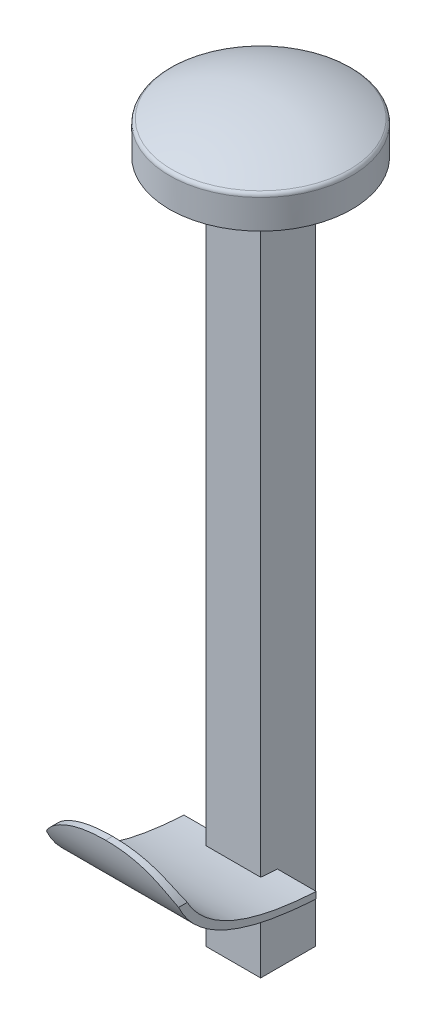
ISO-10303-21;
HEADER;
FILE_DESCRIPTION(('STEP AP214'),'2;1');
FILE_NAME('part.step','',(''),(''),'','','');
FILE_SCHEMA(('AUTOMOTIVE_DESIGN { 1 0 10303 214 1 1 1 1 }'));
ENDSEC;
DATA;
#1=APPLICATION_CONTEXT('core data for automotive mechanical design processes');
#2=APPLICATION_PROTOCOL_DEFINITION('international standard','automotive_design',2000,#1);
#3=PRODUCT_CONTEXT('',#1,'mechanical');
#4=PRODUCT('Part','Part','',(#3));
#5=PRODUCT_RELATED_PRODUCT_CATEGORY('part','',(#4));
#6=PRODUCT_DEFINITION_FORMATION('','',#4);
#7=PRODUCT_DEFINITION_CONTEXT('part definition',#1,'design');
#8=PRODUCT_DEFINITION('design','',#6,#7);
#9=PRODUCT_DEFINITION_SHAPE('','',#8);
#10=(LENGTH_UNIT() NAMED_UNIT(*) SI_UNIT(.MILLI.,.METRE.));
#11=(NAMED_UNIT(*) PLANE_ANGLE_UNIT() SI_UNIT($,.RADIAN.));
#12=(NAMED_UNIT(*) SI_UNIT($,.STERADIAN.) SOLID_ANGLE_UNIT());
#13=UNCERTAINTY_MEASURE_WITH_UNIT(LENGTH_MEASURE(1.E-05),#10,'distance_accuracy_value','');
#14=(GEOMETRIC_REPRESENTATION_CONTEXT(3) GLOBAL_UNCERTAINTY_ASSIGNED_CONTEXT((#13)) GLOBAL_UNIT_ASSIGNED_CONTEXT((#10,
#11,#12)) REPRESENTATION_CONTEXT('',''));
#15=CARTESIAN_POINT('',(0.,0.,0.));
#16=DIRECTION('',(0.,0.,1.));
#17=DIRECTION('',(1.,0.,0.));
#18=AXIS2_PLACEMENT_3D('',#15,#16,#17);
#19=CARTESIAN_POINT('',(0.6,-15.,0.6));
#20=DIRECTION('',(1.,0.,0.));
#21=DIRECTION('',(0.,0.,-1.));
#22=AXIS2_PLACEMENT_3D('',#19,#20,#21);
#23=PLANE('',#22);
#24=DIRECTION('',(0.,-1.,0.));
#25=VECTOR('',#24,1.);
#26=CARTESIAN_POINT('',(0.6,-15.,0.231679409230523));
#27=LINE('',#26,#25);
#28=CARTESIAN_POINT('',(0.6,-13.1147953914325,0.231679409230523));
#29=VERTEX_POINT('',#28);
#30=CARTESIAN_POINT('',(0.6,-13.2544495304418,0.231679409230523));
#31=VERTEX_POINT('',#30);
#32=EDGE_CURVE('E319',#29,#31,#27,.T.);
#33=ORIENTED_EDGE('',*,*,#32,.T.);
#34=CARTESIAN_POINT('',(0.6,-11.2822966361782,3.40038466617353));
#35=CARTESIAN_POINT('',(0.6,-13.0899725130814,3.27973130595993));
#36=CARTESIAN_POINT('',(0.6,-13.2544495304418,0.231679409230523));
#37=B_SPLINE_CURVE_WITH_KNOTS('',2,(#34,#35,#36),.UNSPECIFIED.,.F.,.F.,(3,3),(0.,1.),.UNSPECIFIED.);
#38=CARTESIAN_POINT('',(0.6,-13.2275877017075,0.600000000000006));
#39=VERTEX_POINT('',#38);
#40=EDGE_CURVE('E328',#31,#39,#37,.F.);
#41=ORIENTED_EDGE('',*,*,#40,.T.);
#42=DIRECTION('',(0.,1.,0.));
#43=VECTOR('',#42,1.);
#44=CARTESIAN_POINT('',(0.6,-15.,0.6));
#45=LINE('',#44,#43);
#46=CARTESIAN_POINT('',(0.6,-15.,0.6));
#47=VERTEX_POINT('',#46);
#48=EDGE_CURVE('E243',#47,#39,#45,.T.);
#49=ORIENTED_EDGE('',*,*,#48,.F.);
#50=DIRECTION('',(0.,0.,-1.));
#51=VECTOR('',#50,1.);
#52=CARTESIAN_POINT('',(0.6,-15.,0.6));
#53=LINE('',#52,#51);
#54=CARTESIAN_POINT('',(0.6,-15.,-0.6));
#55=VERTEX_POINT('',#54);
#56=EDGE_CURVE('E340',#47,#55,#53,.T.);
#57=ORIENTED_EDGE('',*,*,#56,.T.);
#58=DIRECTION('',(0.,1.,0.));
#59=VECTOR('',#58,1.);
#60=CARTESIAN_POINT('',(0.6,-15.,-0.6));
#61=LINE('',#60,#59);
#62=CARTESIAN_POINT('',(0.6,0.,-0.6));
#63=VERTEX_POINT('',#62);
#64=EDGE_CURVE('E252',#55,#63,#61,.T.);
#65=ORIENTED_EDGE('',*,*,#64,.T.);
#66=DIRECTION('',(0.,0.,-1.));
#67=VECTOR('',#66,1.);
#68=CARTESIAN_POINT('',(0.6,0.,0.6));
#69=LINE('',#68,#67);
#70=CARTESIAN_POINT('',(0.6,0.,0.6));
#71=VERTEX_POINT('',#70);
#72=EDGE_CURVE('E339',#71,#63,#69,.T.);
#73=ORIENTED_EDGE('',*,*,#72,.F.);
#74=CARTESIAN_POINT('',(0.6,-13.0865291821494,0.6));
#75=VERTEX_POINT('',#74);
#76=EDGE_CURVE('E249',#75,#71,#45,.T.);
#77=ORIENTED_EDGE('',*,*,#76,.F.);
#78=CARTESIAN_POINT('',(0.6,-13.1147953914325,0.231679409230519));
#79=CARTESIAN_POINT('',(0.6,-12.9555523007735,3.05867371334474));
#80=CARTESIAN_POINT('',(0.6,-11.2822966361782,3.25038466617353));
#81=B_SPLINE_CURVE_WITH_KNOTS('',2,(#78,#79,#80),.UNSPECIFIED.,.F.,.F.,(3,3),(0.,1.),.UNSPECIFIED.);
#82=EDGE_CURVE('E314',#75,#29,#81,.F.);
#83=ORIENTED_EDGE('',*,*,#82,.T.);
#84=EDGE_LOOP('',(#33,#41,#49,#57,#65,#73,#77,#83));
#85=FACE_BOUND('',#84,.T.);
#86=ADVANCED_FACE('F33',(#85),#23,.T.);
#87=CARTESIAN_POINT('',(-0.6,-15.,0.6));
#88=DIRECTION('',(0.,0.,1.));
#89=DIRECTION('',(1.,0.,0.));
#90=AXIS2_PLACEMENT_3D('',#87,#88,#89);
#91=PLANE('',#90);
#92=ORIENTED_EDGE('',*,*,#48,.T.);
#93=DIRECTION('',(-1.,0.,0.));
#94=VECTOR('',#93,1.);
#95=CARTESIAN_POINT('',(1.45,-13.2275877017075,0.600000000000006));
#96=LINE('',#95,#94);
#97=CARTESIAN_POINT('',(-0.6,-13.2275877025786,0.599999990644945));
#98=VERTEX_POINT('',#97);
#99=EDGE_CURVE('E325',#39,#98,#96,.T.);
#100=ORIENTED_EDGE('',*,*,#99,.T.);
#101=DIRECTION('',(0.,1.,0.));
#102=VECTOR('',#101,1.);
#103=CARTESIAN_POINT('',(-0.6,-15.,0.6));
#104=LINE('',#103,#102);
#105=CARTESIAN_POINT('',(-0.6,-15.,0.6));
#106=VERTEX_POINT('',#105);
#107=EDGE_CURVE('E363',#106,#98,#104,.T.);
#108=ORIENTED_EDGE('',*,*,#107,.F.);
#109=DIRECTION('',(1.,0.,0.));
#110=VECTOR('',#109,1.);
#111=CARTESIAN_POINT('',(-0.6,-15.,0.6));
#112=LINE('',#111,#110);
#113=EDGE_CURVE('E350',#106,#47,#112,.T.);
#114=ORIENTED_EDGE('',*,*,#113,.T.);
#115=EDGE_LOOP('',(#92,#100,#108,#114));
#116=FACE_BOUND('',#115,.T.);
#117=ADVANCED_FACE('F220',(#116),#91,.T.);
#118=CARTESIAN_POINT('',(-0.6,-13.0865291830655,0.6));
#119=VERTEX_POINT('',#118);
#120=CARTESIAN_POINT('',(-0.6,0.,0.6));
#121=VERTEX_POINT('',#120);
#122=EDGE_CURVE('E365',#119,#121,#104,.T.);
#123=ORIENTED_EDGE('',*,*,#122,.F.);
#124=DIRECTION('',(-1.,0.,0.));
#125=VECTOR('',#124,1.);
#126=CARTESIAN_POINT('',(1.45,-13.0865291821494,0.6));
#127=LINE('',#126,#125);
#128=EDGE_CURVE('E56',#119,#75,#127,.F.);
#129=ORIENTED_EDGE('',*,*,#128,.T.);
#130=ORIENTED_EDGE('',*,*,#76,.T.);
#131=DIRECTION('',(1.,0.,0.));
#132=VECTOR('',#131,1.);
#133=CARTESIAN_POINT('',(-0.6,0.,0.6));
#134=LINE('',#133,#132);
#135=EDGE_CURVE('E344',#121,#71,#134,.T.);
#136=ORIENTED_EDGE('',*,*,#135,.F.);
#137=EDGE_LOOP('',(#123,#129,#130,#136));
#138=FACE_BOUND('',#137,.T.);
#139=ADVANCED_FACE('F223',(#138),#91,.T.);
#140=CARTESIAN_POINT('',(-0.6,-15.,0.6));
#141=DIRECTION('',(-1.,0.,0.));
#142=DIRECTION('',(0.,0.,1.));
#143=AXIS2_PLACEMENT_3D('',#140,#141,#142);
#144=PLANE('',#143);
#145=ORIENTED_EDGE('',*,*,#107,.T.);
#146=CARTESIAN_POINT('',(-0.6,-11.2822966361782,3.40038466617353));
#147=CARTESIAN_POINT('',(-0.6,-13.0899725130814,3.27973130595993));
#148=CARTESIAN_POINT('',(-0.6,-13.2544495304418,0.231679409230523));
#149=B_SPLINE_CURVE_WITH_KNOTS('',2,(#146,#147,#148),.UNSPECIFIED.,.F.,.F.,(3,3),(0.,1.),.UNSPECIFIED.);
#150=CARTESIAN_POINT('',(-0.6,-13.2544495304418,0.231679409230523));
#151=VERTEX_POINT('',#150);
#152=EDGE_CURVE('E264',#98,#151,#149,.T.);
#153=ORIENTED_EDGE('',*,*,#152,.T.);
#154=DIRECTION('',(0.,1.,0.));
#155=VECTOR('',#154,1.);
#156=CARTESIAN_POINT('',(-0.6,-15.,0.231679409230523));
#157=LINE('',#156,#155);
#158=CARTESIAN_POINT('',(-0.6,-13.1147953914325,0.231679409230523));
#159=VERTEX_POINT('',#158);
#160=EDGE_CURVE('E258',#151,#159,#157,.T.);
#161=ORIENTED_EDGE('',*,*,#160,.T.);
#162=CARTESIAN_POINT('',(-0.6,-13.1147953914325,0.231679409230519));
#163=CARTESIAN_POINT('',(-0.6,-12.9555523007735,3.05867371334474));
#164=CARTESIAN_POINT('',(-0.6,-11.2822966361782,3.25038466617353));
#165=B_SPLINE_CURVE_WITH_KNOTS('',2,(#162,#163,#164),.UNSPECIFIED.,.F.,.F.,(3,3),(0.,1.),.UNSPECIFIED.);
#166=EDGE_CURVE('E246',#159,#119,#165,.T.);
#167=ORIENTED_EDGE('',*,*,#166,.T.);
#168=ORIENTED_EDGE('',*,*,#122,.T.);
#169=DIRECTION('',(0.,0.,1.));
#170=VECTOR('',#169,1.);
#171=CARTESIAN_POINT('',(-0.6,0.,0.6));
#172=LINE('',#171,#170);
#173=CARTESIAN_POINT('',(-0.6,0.,-0.6));
#174=VERTEX_POINT('',#173);
#175=EDGE_CURVE('E358',#174,#121,#172,.T.);
#176=ORIENTED_EDGE('',*,*,#175,.F.);
#177=DIRECTION('',(0.,1.,0.));
#178=VECTOR('',#177,1.);
#179=CARTESIAN_POINT('',(-0.6,-15.,-0.6));
#180=LINE('',#179,#178);
#181=CARTESIAN_POINT('',(-0.6,-15.,-0.6));
#182=VERTEX_POINT('',#181);
#183=EDGE_CURVE('E366',#182,#174,#180,.T.);
#184=ORIENTED_EDGE('',*,*,#183,.F.);
#185=DIRECTION('',(0.,0.,1.));
#186=VECTOR('',#185,1.);
#187=CARTESIAN_POINT('',(-0.6,-15.,0.6));
#188=LINE('',#187,#186);
#189=EDGE_CURVE('E347',#182,#106,#188,.T.);
#190=ORIENTED_EDGE('',*,*,#189,.T.);
#191=EDGE_LOOP('',(#145,#153,#161,#167,#168,#176,#184,#190));
#192=FACE_BOUND('',#191,.T.);
#193=ADVANCED_FACE('F225',(#192),#144,.T.);
#194=CARTESIAN_POINT('',(-0.6,-15.,-0.6));
#195=DIRECTION('',(0.,0.,-1.));
#196=DIRECTION('',(-1.,0.,0.));
#197=AXIS2_PLACEMENT_3D('',#194,#195,#196);
#198=PLANE('',#197);
#199=DIRECTION('',(-1.,0.,0.));
#200=VECTOR('',#199,1.);
#201=CARTESIAN_POINT('',(-0.6,0.,-0.6));
#202=LINE('',#201,#200);
#203=EDGE_CURVE('E355',#63,#174,#202,.T.);
#204=ORIENTED_EDGE('',*,*,#203,.F.);
#205=ORIENTED_EDGE('',*,*,#64,.F.);
#206=DIRECTION('',(-1.,0.,0.));
#207=VECTOR('',#206,1.);
#208=CARTESIAN_POINT('',(-0.6,-15.,-0.6));
#209=LINE('',#208,#207);
#210=EDGE_CURVE('E343',#55,#182,#209,.T.);
#211=ORIENTED_EDGE('',*,*,#210,.T.);
#212=ORIENTED_EDGE('',*,*,#183,.T.);
#213=EDGE_LOOP('',(#204,#205,#211,#212));
#214=FACE_BOUND('',#213,.T.);
#215=ADVANCED_FACE('F218',(#214),#198,.T.);
#216=CARTESIAN_POINT('',(0.,-15.,0.));
#217=DIRECTION('',(0.,-1.,0.));
#218=DIRECTION('',(0.,0.,-1.));
#219=AXIS2_PLACEMENT_3D('',#216,#217,#218);
#220=PLANE('',#219);
#221=ORIENTED_EDGE('',*,*,#56,.F.);
#222=ORIENTED_EDGE('',*,*,#113,.F.);
#223=ORIENTED_EDGE('',*,*,#189,.F.);
#224=ORIENTED_EDGE('',*,*,#210,.F.);
#225=EDGE_LOOP('',(#221,#222,#223,#224));
#226=FACE_BOUND('',#225,.T.);
#227=ADVANCED_FACE('F214',(#226),#220,.T.);
#228=CARTESIAN_POINT('',(0.,0.7,0.));
#229=DIRECTION('',(0.,-1.,0.));
#230=DIRECTION('',(0.,0.,-1.));
#231=AXIS2_PLACEMENT_3D('',#228,#229,#230);
#232=CYLINDRICAL_SURFACE('',#231,2.);
#233=CARTESIAN_POINT('',(0.,0.639512162874653,0.));
#234=DIRECTION('',(0.,-1.,0.));
#235=DIRECTION('',(0.,0.,-1.));
#236=AXIS2_PLACEMENT_3D('',#233,#234,#235);
#237=CIRCLE('',#236,2.);
#238=CARTESIAN_POINT('',(0.,0.639512162874653,-2.));
#239=VERTEX_POINT('',#238);
#240=EDGE_CURVE('E242',#239,#239,#237,.T.);
#241=ORIENTED_EDGE('',*,*,#240,.T.);
#242=EDGE_LOOP('',(#241));
#243=FACE_BOUND('',#242,.T.);
#244=CARTESIAN_POINT('',(0.,0.,0.));
#245=DIRECTION('',(0.,1.,0.));
#246=DIRECTION('',(0.,0.,1.));
#247=AXIS2_PLACEMENT_3D('',#244,#245,#246);
#248=CIRCLE('',#247,2.);
#249=CARTESIAN_POINT('',(0.,0.,2.));
#250=VERTEX_POINT('',#249);
#251=EDGE_CURVE('E333',#250,#250,#248,.T.);
#252=ORIENTED_EDGE('',*,*,#251,.T.);
#253=EDGE_LOOP('',(#252));
#254=FACE_BOUND('',#253,.T.);
#255=ADVANCED_FACE('F211',(#243,#254),#232,.T.);
#256=CARTESIAN_POINT('',(0.,-3.05,0.));
#257=DIRECTION('',(0.,0.,1.));
#258=DIRECTION('',(1.,0.,0.));
#259=AXIS2_PLACEMENT_3D('',#256,#257,#258);
#260=SPHERICAL_SURFACE('',#259,4.25);
#261=CARTESIAN_POINT('',(0.,-3.05,0.));
#262=DIRECTION('',(0.,-1.,0.));
#263=DIRECTION('',(0.,0.,-1.));
#264=AXIS2_PLACEMENT_3D('',#261,#262,#263);
#265=SPHERICAL_SURFACE('',#264,4.25);
#266=CARTESIAN_POINT('',(0.,0.728416070413801,0.));
#267=DIRECTION('',(0.,-1.,0.));
#268=DIRECTION('',(0.,0.,-1.));
#269=AXIS2_PLACEMENT_3D('',#266,#267,#268);
#270=CIRCLE('',#269,1.94578313253012);
#271=CARTESIAN_POINT('',(0.,0.728416070413801,-1.94578313253012));
#272=VERTEX_POINT('',#271);
#273=EDGE_CURVE('E240',#272,#272,#270,.F.);
#274=ORIENTED_EDGE('',*,*,#273,.T.);
#275=EDGE_LOOP('',(#274));
#276=FACE_BOUND('',#275,.T.);
#277=ADVANCED_FACE('F209',(#276),#265,.T.);
#278=CARTESIAN_POINT('',(0.,0.,0.));
#279=DIRECTION('',(0.,1.,0.));
#280=DIRECTION('',(0.,0.,1.));
#281=AXIS2_PLACEMENT_3D('',#278,#279,#280);
#282=PLANE('',#281);
#283=ORIENTED_EDGE('',*,*,#72,.T.);
#284=ORIENTED_EDGE('',*,*,#203,.T.);
#285=ORIENTED_EDGE('',*,*,#175,.T.);
#286=ORIENTED_EDGE('',*,*,#135,.T.);
#287=EDGE_LOOP('',(#283,#284,#285,#286));
#288=FACE_BOUND('',#287,.T.);
#289=ORIENTED_EDGE('',*,*,#251,.F.);
#290=EDGE_LOOP('',(#289));
#291=FACE_BOUND('',#290,.T.);
#292=ADVANCED_FACE('F205',(#288,#291),#282,.F.);
#293=CARTESIAN_POINT('',(0.,0.639512162874653,0.));
#294=DIRECTION('',(0.,-1.,0.));
#295=DIRECTION('',(0.,0.,-1.));
#296=AXIS2_PLACEMENT_3D('',#293,#294,#295);
#297=TOROIDAL_SURFACE('',#296,1.9,0.1);
#298=ORIENTED_EDGE('',*,*,#240,.F.);
#299=EDGE_LOOP('',(#298));
#300=FACE_BOUND('',#299,.T.);
#301=ORIENTED_EDGE('',*,*,#273,.F.);
#302=EDGE_LOOP('',(#301));
#303=FACE_BOUND('',#302,.T.);
#304=ADVANCED_FACE('F35',(#300,#303),#297,.T.);
#305=CARTESIAN_POINT('',(1.45,-13.1147953914325,0.231679409230523));
#306=DIRECTION('',(0.,0.,1.));
#307=DIRECTION('',(1.,0.,0.));
#308=AXIS2_PLACEMENT_3D('',#305,#306,#307);
#309=PLANE('',#308);
#310=ORIENTED_EDGE('',*,*,#32,.F.);
#311=DIRECTION('',(-1.,0.,0.));
#312=VECTOR('',#311,1.);
#313=CARTESIAN_POINT('',(1.45,-13.1147953914325,0.231679409230523));
#314=LINE('',#313,#312);
#315=CARTESIAN_POINT('',(1.45,-13.1147953914325,0.231679409230523));
#316=VERTEX_POINT('',#315);
#317=EDGE_CURVE('E285',#316,#29,#314,.T.);
#318=ORIENTED_EDGE('',*,*,#317,.F.);
#319=DIRECTION('',(0.,1.,0.));
#320=VECTOR('',#319,1.);
#321=CARTESIAN_POINT('',(1.45,-13.1147953914325,0.231679409230523));
#322=LINE('',#321,#320);
#323=CARTESIAN_POINT('',(1.45,-13.2544495304418,0.231679409230523));
#324=VERTEX_POINT('',#323);
#325=EDGE_CURVE('E281',#324,#316,#322,.T.);
#326=ORIENTED_EDGE('',*,*,#325,.F.);
#327=DIRECTION('',(-1.,0.,0.));
#328=VECTOR('',#327,1.);
#329=CARTESIAN_POINT('',(1.45,-13.2544495304418,0.231679409230523));
#330=LINE('',#329,#328);
#331=EDGE_CURVE('E310',#324,#31,#330,.T.);
#332=ORIENTED_EDGE('',*,*,#331,.T.);
#333=EDGE_LOOP('',(#310,#318,#326,#332));
#334=FACE_BOUND('',#333,.T.);
#335=ADVANCED_FACE('F203',(#334),#309,.F.);
#336=CARTESIAN_POINT('',(1.45,-11.2822966361782,3.40038466617353));
#337=CARTESIAN_POINT('',(1.45,-13.0899725130814,3.27973130595993));
#338=CARTESIAN_POINT('',(1.45,-13.2544495304418,0.231679409230523));
#339=B_SPLINE_CURVE_WITH_KNOTS('',2,(#336,#337,#338),.UNSPECIFIED.,.F.,.F.,(3,3),(0.,1.),.UNSPECIFIED.);
#340=DIRECTION('',(-1.,0.,0.));
#341=VECTOR('',#340,1.);
#342=SURFACE_OF_LINEAR_EXTRUSION('',#339,#341);
#343=CARTESIAN_POINT('',(1.45,-11.9088053983222,3.24934951916116));
#344=VERTEX_POINT('',#343);
#345=EDGE_CURVE('E193',#344,#324,#339,.T.);
#346=ORIENTED_EDGE('',*,*,#345,.F.);
#347=CARTESIAN_POINT('',(1.45,-11.9088053983222,3.24934952030039));
#348=CARTESIAN_POINT('',(1.43209086909889,-11.8824739749466,3.26125065203179));
#349=CARTESIAN_POINT('',(1.41301831415374,-11.8564774593776,3.27213410331805));
#350=CARTESIAN_POINT('',(1.37263271580729,-11.8055517308266,3.29201932509979));
#351=CARTESIAN_POINT('',(1.3513209466864,-11.7806219220546,3.30102215718458));
#352=CARTESIAN_POINT('',(1.30673879784926,-11.7324298684638,3.31723439768556));
#353=CARTESIAN_POINT('',(1.28348928340076,-11.7091538631586,3.32446026065177));
#354=CARTESIAN_POINT('',(1.23503195343132,-11.6643025991762,3.33743383390888));
#355=CARTESIAN_POINT('',(1.20982407960209,-11.6427273911774,3.3431815001659));
#356=CARTESIAN_POINT('',(1.13163368759762,-11.5809525947777,3.35852392104764));
#357=CARTESIAN_POINT('',(1.07599002531331,-11.5436015030161,3.36625002605092));
#358=CARTESIAN_POINT('',(0.959570366887024,-11.4772187084085,3.37839166681402));
#359=CARTESIAN_POINT('',(0.898783615694367,-11.4482050263387,3.38280006434307));
#360=CARTESIAN_POINT('',(0.787745266314783,-11.4036480363033,3.38885114047055));
#361=CARTESIAN_POINT('',(0.738124345587958,-11.3865452379275,3.3908892323137));
#362=CARTESIAN_POINT('',(0.637543499359318,-11.3567271857328,3.3941592938901));
#363=CARTESIAN_POINT('',(0.586582751503276,-11.3440146975904,3.3953907559231));
#364=CARTESIAN_POINT('',(0.4322612771528,-11.3116904021231,3.39833926992597));
#365=CARTESIAN_POINT('',(0.327633033363799,-11.2979559247601,3.39930360307876));
#366=CARTESIAN_POINT('',(0.185563943596458,-11.2874882560939,3.40003103665554));
#367=CARTESIAN_POINT('',(0.148365142391725,-11.2855036558504,3.4001677134941));
#368=CARTESIAN_POINT('',(0.0741154311563454,-11.2829125873477,3.40034475106083));
#369=CARTESIAN_POINT('',(0.0370647793662433,-11.2822988864633,3.40038561732575));
#370=CARTESIAN_POINT('',(0.,-11.2822966361782,3.40038466617353));
#371=B_SPLINE_CURVE_WITH_KNOTS('',3,(#347,#348,#349,#350,#351,#352,#353,#354,#355,#356,#357,
#358,#359,#360,#361,#362,#363,#364,#365,#366,#367,#368,#369,#370),.UNSPECIFIED.,.F.,.F.,(4,2,2,
2,2,2,2,2,2,2,2,4),(0.,0.101947827344852,0.203837949789108,0.304745689454117,0.405656434703983,
0.607055334481566,0.808886325953734,0.966235775021782,1.12368416636158,1.43912495951979,
1.55087424765936,1.66203255956032),.UNSPECIFIED.);
#372=CARTESIAN_POINT('',(0.,-11.2822966361782,3.40038466617353));
#373=VERTEX_POINT('',#372);
#374=EDGE_CURVE('E135',#344,#373,#371,.T.);
#375=ORIENTED_EDGE('',*,*,#374,.T.);
#376=CARTESIAN_POINT('',(0.,-11.2822966361782,3.40038466617353));
#377=CARTESIAN_POINT('',(-0.0565959525179161,-11.2823102490029,3.40037399735679));
#378=CARTESIAN_POINT('',(-0.113223586391407,-11.2837350077479,3.4002876736812));
#379=CARTESIAN_POINT('',(-0.22644954128403,-11.2899293075039,3.39986664896325));
#380=CARTESIAN_POINT('',(-0.283047329922659,-11.2947082636571,3.39953124861509));
#381=CARTESIAN_POINT('',(-0.396634880816,-11.3082387643143,3.39850643025248));
#382=CARTESIAN_POINT('',(-0.453618014022299,-11.3170481549776,3.39781183738383));
#383=CARTESIAN_POINT('',(-0.56661403674673,-11.3392716517808,3.39584627449918));
#384=CARTESIAN_POINT('',(-0.622627965006768,-11.3526804600949,3.39457596707986));
#385=CARTESIAN_POINT('',(-0.749287389432965,-11.3894412123304,3.3906021505441));
#386=CARTESIAN_POINT('',(-0.819431594598115,-11.4145529985423,3.38758854459759));
#387=CARTESIAN_POINT('',(-0.954981386891236,-11.4746601564423,3.3787447466682));
#388=CARTESIAN_POINT('',(-1.02040508675389,-11.5096149138197,3.3729260602652));
#389=CARTESIAN_POINT('',(-1.11363299536872,-11.5698062274826,3.36057618006418));
#390=CARTESIAN_POINT('',(-1.14409237183304,-11.5913472747574,3.35580809662948));
#391=CARTESIAN_POINT('',(-1.20285351482054,-11.6368320092052,3.34473925127545));
#392=CARTESIAN_POINT('',(-1.23115644994918,-11.6607743785367,3.33843932735276));
#393=CARTESIAN_POINT('',(-1.28527510744216,-11.7107502194293,3.32401299668349));
#394=CARTESIAN_POINT('',(-1.31109407617326,-11.7367808778002,3.31588902146838));
#395=CARTESIAN_POINT('',(-1.36005641932565,-11.7905326558687,3.29753341362979));
#396=CARTESIAN_POINT('',(-1.38320193168449,-11.81825239734,3.28730348359163));
#397=CARTESIAN_POINT('',(-1.41283027534128,-11.856798353774,3.27179437304193));
#398=CARTESIAN_POINT('',(-1.42052253275474,-11.8671193083931,3.26752072307189));
#399=CARTESIAN_POINT('',(-1.43553598045608,-11.8878778184843,3.25866741147943));
#400=CARTESIAN_POINT('',(-1.44285760564309,-11.8983152188944,3.25408812384884));
#401=CARTESIAN_POINT('',(-1.45000000000005,-11.9088053983221,3.24934952030042));
#402=B_SPLINE_CURVE_WITH_KNOTS('',3,(#376,#377,#378,#379,#380,#381,#382,#383,#384,#385,#386,
#387,#388,#389,#390,#391,#392,#393,#394,#395,#396,#397,#398,#399,#400,#401),.UNSPECIFIED.,.F.,
.F.,(4,2,2,2,2,2,2,2,2,2,2,2,4),(0.,0.16981764128963,0.340113872460541,0.512934872354031,
0.685557473646718,0.908564262733787,1.13066402999565,1.24335065416665,1.3559757710225,
1.46845163629165,1.58083692366758,1.621519328359,1.66215283392657),.UNSPECIFIED.);
#403=CARTESIAN_POINT('',(-1.45,-11.9088053983222,3.24934951916116));
#404=VERTEX_POINT('',#403);
#405=EDGE_CURVE('E136',#373,#404,#402,.T.);
#406=ORIENTED_EDGE('',*,*,#405,.T.);
#407=CARTESIAN_POINT('',(-1.45,-11.2822966361782,3.40038466617353));
#408=CARTESIAN_POINT('',(-1.45,-13.0899725130814,3.27973130595993));
#409=CARTESIAN_POINT('',(-1.45,-13.2544495304418,0.231679409230523));
#410=B_SPLINE_CURVE_WITH_KNOTS('',2,(#407,#408,#409),.UNSPECIFIED.,.F.,.F.,(3,3),(0.,1.),.UNSPECIFIED.);
#411=CARTESIAN_POINT('',(-1.45,-13.2544495304418,0.231679409230523));
#412=VERTEX_POINT('',#411);
#413=EDGE_CURVE('E192',#404,#412,#410,.T.);
#414=ORIENTED_EDGE('',*,*,#413,.T.);
#415=EDGE_CURVE('E309',#151,#412,#330,.T.);
#416=ORIENTED_EDGE('',*,*,#415,.F.);
#417=ORIENTED_EDGE('',*,*,#152,.F.);
#418=ORIENTED_EDGE('',*,*,#99,.F.);
#419=ORIENTED_EDGE('',*,*,#40,.F.);
#420=ORIENTED_EDGE('',*,*,#331,.F.);
#421=EDGE_LOOP('',(#346,#375,#406,#414,#416,#417,#418,#419,#420));
#422=FACE_BOUND('',#421,.T.);
#423=ADVANCED_FACE('F198',(#422),#342,.F.);
#424=ORIENTED_EDGE('',*,*,#160,.F.);
#425=ORIENTED_EDGE('',*,*,#415,.T.);
#426=DIRECTION('',(0.,1.,0.));
#427=VECTOR('',#426,1.);
#428=CARTESIAN_POINT('',(-1.45,-13.1147953914325,0.231679409230523));
#429=LINE('',#428,#427);
#430=CARTESIAN_POINT('',(-1.45,-13.1147953914325,0.231679409230523));
#431=VERTEX_POINT('',#430);
#432=EDGE_CURVE('E297',#412,#431,#429,.T.);
#433=ORIENTED_EDGE('',*,*,#432,.T.);
#434=EDGE_CURVE('E284',#159,#431,#314,.T.);
#435=ORIENTED_EDGE('',*,*,#434,.F.);
#436=EDGE_LOOP('',(#424,#425,#433,#435));
#437=FACE_BOUND('',#436,.T.);
#438=ADVANCED_FACE('F202',(#437),#309,.F.);
#439=CARTESIAN_POINT('',(1.45,-13.1147953914325,0.231679409230519));
#440=CARTESIAN_POINT('',(1.45,-12.9555523007735,3.05867371334474));
#441=CARTESIAN_POINT('',(1.45,-11.2822966361782,3.25038466617353));
#442=B_SPLINE_CURVE_WITH_KNOTS('',2,(#439,#440,#441),.UNSPECIFIED.,.F.,.F.,(3,3),(0.,1.),.UNSPECIFIED.);
#443=DIRECTION('',(-1.,0.,0.));
#444=VECTOR('',#443,1.);
#445=SURFACE_OF_LINEAR_EXTRUSION('',#442,#444);
#446=CARTESIAN_POINT('',(-1.45,-11.9088053983222,3.05882547745143));
#447=CARTESIAN_POINT('',(-1.43284793340806,-11.883588612597,3.07247349815652));
#448=CARTESIAN_POINT('',(-1.41456672715221,-11.8585869903981,3.08509719296298));
#449=CARTESIAN_POINT('',(-1.37580760218546,-11.8094177250805,3.10840500957885));
#450=CARTESIAN_POINT('',(-1.35533074559003,-11.7852496861387,3.11909006250528));
#451=CARTESIAN_POINT('',(-1.31242954916155,-11.7383495229776,3.13854993547235));
#452=CARTESIAN_POINT('',(-1.2900255077643,-11.7156059599394,3.14734190134926));
#453=CARTESIAN_POINT('',(-1.24326234948341,-11.671626738566,3.16331638398273));
#454=CARTESIAN_POINT('',(-1.21890322845585,-11.6503910834271,3.17049889732784));
#455=CARTESIAN_POINT('',(-1.14321426565299,-11.5893682554979,3.18992108469811));
#456=CARTESIAN_POINT('',(-1.0892010105591,-11.5521861723862,3.20006617766444));
#457=CARTESIAN_POINT('',(-0.975935847011846,-11.485734141261,3.21642209465019));
#458=CARTESIAN_POINT('',(-0.916673910778248,-11.4564797918076,3.22262519420636));
#459=CARTESIAN_POINT('',(-0.809042944328183,-11.4116172206298,3.23132531462971));
#460=CARTESIAN_POINT('',(-0.761361648121919,-11.3944176411614,3.23434950436084));
#461=CARTESIAN_POINT('',(-0.664632478804275,-11.3641784328833,3.23934452704094));
#462=CARTESIAN_POINT('',(-0.615583800692822,-11.3511413133217,3.24131472509555));
#463=CARTESIAN_POINT('',(-0.466901720220225,-11.3175825451623,3.24616503746172));
#464=CARTESIAN_POINT('',(-0.365942012982798,-11.3026954312571,3.24797151449744));
#465=CARTESIAN_POINT('',(-0.220465485763319,-11.289694351808,3.24952371916684));
#466=CARTESIAN_POINT('',(-0.176254326609848,-11.2868558730349,3.2498570858636));
#467=CARTESIAN_POINT('',(-0.0880330905912737,-11.2831661332388,3.25028655288794));
#468=CARTESIAN_POINT('',(-0.0440235665345233,-11.2823021174999,3.25038417631328));
#469=CARTESIAN_POINT('',(0.,-11.2822966361782,3.25038466617353));
#470=B_SPLINE_CURVE_WITH_KNOTS('',3,(#446,#447,#448,#449,#450,#451,#452,#453,#454,#455,#456,
#457,#458,#459,#460,#461,#462,#463,#464,#465,#466,#467,#468,#469),.UNSPECIFIED.,.F.,.F.,(4,2,2,
2,2,2,2,2,2,2,2,4),(0.,0.100199327351853,0.200350401484393,0.299552213601671,0.398754235988861,
0.596829480043647,0.795291671740478,0.947411363447353,1.09962258480847,1.40471391907886,
1.53760333389592,1.66963184785068),.UNSPECIFIED.);
#471=CARTESIAN_POINT('',(-1.45,-11.9088054064231,3.05882547306985));
#472=VERTEX_POINT('',#471);
#473=CARTESIAN_POINT('',(0.,-11.2822966361782,3.25038466617353));
#474=VERTEX_POINT('',#473);
#475=EDGE_CURVE('E48',#472,#474,#470,.T.);
#476=ORIENTED_EDGE('',*,*,#475,.T.);
#477=CARTESIAN_POINT('',(0.,-11.2822966361782,3.25038466617353));
#478=CARTESIAN_POINT('',(0.0565859991671263,-11.2823101159814,3.25037257590209));
#479=CARTESIAN_POINT('',(0.1132041380054,-11.2837344927612,3.25021885230542));
#480=CARTESIAN_POINT('',(0.226413695108602,-11.2899267920347,3.24950120945531));
#481=CARTESIAN_POINT('',(0.28300456203583,-11.2947043771082,3.24893610459322));
#482=CARTESIAN_POINT('',(0.396602497345849,-11.3082336837692,3.24725458223599));
#483=CARTESIAN_POINT('',(0.453602641246732,-11.3170452220329,3.24612984369933));
#484=CARTESIAN_POINT('',(0.566619371861496,-11.3392726106734,3.24306194321012));
#485=CARTESIAN_POINT('',(0.622637043741668,-11.3526829942455,3.2411197523707));
#486=CARTESIAN_POINT('',(0.748274965602354,-11.3891475018581,3.23530970409903));
#487=CARTESIAN_POINT('',(0.817420762638441,-11.413836671568,3.23106022892479));
#488=CARTESIAN_POINT('',(0.951030524559233,-11.4727423466175,3.21921846588915));
#489=CARTESIAN_POINT('',(1.01551321835265,-11.5069177243303,3.21164052784296));
#490=CARTESIAN_POINT('',(1.107408787236,-11.5655837147407,3.19621444454012));
#491=CARTESIAN_POINT('',(1.13743551377857,-11.5865524887177,3.19033814090764));
#492=CARTESIAN_POINT('',(1.19536371829905,-11.6307556073025,3.17691383035436));
#493=CARTESIAN_POINT('',(1.22326634949119,-11.6539887067107,3.16936673936291));
#494=CARTESIAN_POINT('',(1.27662943817739,-11.7024007713887,3.15232208616041));
#495=CARTESIAN_POINT('',(1.30209244121462,-11.7275776578219,3.14282659018426));
#496=CARTESIAN_POINT('',(1.35038440959375,-11.7794573694322,3.12163323562083));
#497=CARTESIAN_POINT('',(1.37321533010974,-11.8061590396261,3.10993702899678));
#498=CARTESIAN_POINT('',(1.40447122831517,-11.8457667434048,3.09118003340752));
#499=CARTESIAN_POINT('',(1.41397856226051,-11.8582785637229,3.08505734355931));
#500=CARTESIAN_POINT('',(1.43241650256809,-11.8834439256005,3.07231667069179));
#501=CARTESIAN_POINT('',(1.44134786181278,-11.8960972556966,3.06569935970375));
#502=CARTESIAN_POINT('',(1.45000000000037,-11.9088053983219,3.05882547745157));
#503=B_SPLINE_CURVE_WITH_KNOTS('',3,(#477,#478,#479,#480,#481,#482,#483,#484,#485,#486,#487,
#488,#489,#490,#491,#492,#493,#494,#495,#496,#497,#498,#499,#500,#501,#502),.UNSPECIFIED.,.F.,
.F.,(4,2,2,2,2,2,2,2,2,2,2,2,4),(0.,0.169788380628174,0.340068041676991,0.512958798982002,
0.685644743488044,0.905605963184354,1.12462804450167,1.23576226037011,1.34683570241846,
1.45779195703395,1.56866525225105,1.61924489172377,1.66975701697921),.UNSPECIFIED.);
#504=CARTESIAN_POINT('',(1.45,-11.9088053983222,3.05882547306985));
#505=VERTEX_POINT('',#504);
#506=EDGE_CURVE('E128',#474,#505,#503,.T.);
#507=ORIENTED_EDGE('',*,*,#506,.T.);
#508=EDGE_CURVE('E280',#316,#505,#442,.T.);
#509=ORIENTED_EDGE('',*,*,#508,.F.);
#510=ORIENTED_EDGE('',*,*,#317,.T.);
#511=ORIENTED_EDGE('',*,*,#82,.F.);
#512=ORIENTED_EDGE('',*,*,#128,.F.);
#513=ORIENTED_EDGE('',*,*,#166,.F.);
#514=ORIENTED_EDGE('',*,*,#434,.T.);
#515=CARTESIAN_POINT('',(-1.45,-13.1147953914325,0.231679409230519));
#516=CARTESIAN_POINT('',(-1.45,-12.9555523007735,3.05867371334474));
#517=CARTESIAN_POINT('',(-1.45,-11.2822966361782,3.25038466617353));
#518=B_SPLINE_CURVE_WITH_KNOTS('',2,(#515,#516,#517),.UNSPECIFIED.,.F.,.F.,(3,3),(0.,1.),.UNSPECIFIED.);
#519=EDGE_CURVE('E144',#431,#472,#518,.T.);
#520=ORIENTED_EDGE('',*,*,#519,.T.);
#521=EDGE_LOOP('',(#476,#507,#509,#510,#511,#512,#513,#514,#520));
#522=FACE_BOUND('',#521,.T.);
#523=ADVANCED_FACE('F142',(#522),#445,.F.);
#524=CARTESIAN_POINT('',(1.45,-12.6791727981957,2.54788167183098));
#525=DIRECTION('',(1.,0.,0.));
#526=DIRECTION('',(0.,0.,-1.));
#527=AXIS2_PLACEMENT_3D('',#524,#525,#526);
#528=PLANE('',#527);
#529=DIRECTION('',(0.,0.,1.));
#530=VECTOR('',#529,1.);
#531=CARTESIAN_POINT('',(1.45,-11.9088053983222,2.6));
#532=LINE('',#531,#530);
#533=EDGE_CURVE('E11',#344,#505,#532,.F.);
#534=ORIENTED_EDGE('',*,*,#533,.F.);
#535=ORIENTED_EDGE('',*,*,#345,.T.);
#536=ORIENTED_EDGE('',*,*,#325,.T.);
#537=ORIENTED_EDGE('',*,*,#508,.T.);
#538=EDGE_LOOP('',(#534,#535,#536,#537));
#539=FACE_BOUND('',#538,.T.);
#540=ADVANCED_FACE('F182',(#539),#528,.T.);
#541=CARTESIAN_POINT('',(-1.45,-12.6791727981957,2.54788167183098));
#542=DIRECTION('',(1.,0.,0.));
#543=DIRECTION('',(0.,0.,-1.));
#544=AXIS2_PLACEMENT_3D('',#541,#542,#543);
#545=PLANE('',#544);
#546=ORIENTED_EDGE('',*,*,#413,.F.);
#547=DIRECTION('',(0.,0.,1.));
#548=VECTOR('',#547,1.);
#549=CARTESIAN_POINT('',(-1.45,-11.9088053983222,2.6));
#550=LINE('',#549,#548);
#551=EDGE_CURVE('E41',#404,#472,#550,.F.);
#552=ORIENTED_EDGE('',*,*,#551,.T.);
#553=ORIENTED_EDGE('',*,*,#519,.F.);
#554=ORIENTED_EDGE('',*,*,#432,.F.);
#555=EDGE_LOOP('',(#546,#552,#553,#554));
#556=FACE_BOUND('',#555,.T.);
#557=ADVANCED_FACE('F181',(#556),#545,.F.);
#558=CARTESIAN_POINT('',(0.,-11.2822966361782,2.6));
#559=CARTESIAN_POINT('',(1.29782262907156,-11.2822966361782,2.6));
#560=CARTESIAN_POINT('',(1.63581938938096,-12.2897703922953,2.6));
#561=B_SPLINE_CURVE_WITH_KNOTS('',2,(#558,#559,#560),.UNSPECIFIED.,.F.,.F.,(3,3),(0.,1.),.UNSPECIFIED.);
#562=DIRECTION('',(0.,0.,1.));
#563=VECTOR('',#562,1.);
#564=SURFACE_OF_LINEAR_EXTRUSION('',#561,#563);
#565=ORIENTED_EDGE('',*,*,#533,.T.);
#566=ORIENTED_EDGE('',*,*,#506,.F.);
#567=DIRECTION('',(0.,0.,1.));
#568=VECTOR('',#567,1.);
#569=CARTESIAN_POINT('',(0.,-11.2822966361782,2.6));
#570=LINE('',#569,#568);
#571=EDGE_CURVE('E130',#474,#373,#570,.T.);
#572=ORIENTED_EDGE('',*,*,#571,.T.);
#573=ORIENTED_EDGE('',*,*,#374,.F.);
#574=EDGE_LOOP('',(#565,#566,#572,#573));
#575=FACE_BOUND('',#574,.T.);
#576=ADVANCED_FACE('F129',(#575),#564,.F.);
#577=CARTESIAN_POINT('',(-1.63581938938096,-12.2897703922953,2.6));
#578=CARTESIAN_POINT('',(-1.29782262907156,-11.2822966361782,2.6));
#579=CARTESIAN_POINT('',(0.,-11.2822966361782,2.6));
#580=B_SPLINE_CURVE_WITH_KNOTS('',2,(#577,#578,#579),.UNSPECIFIED.,.F.,.F.,(3,3),(0.,1.),.UNSPECIFIED.);
#581=DIRECTION('',(0.,0.,1.));
#582=VECTOR('',#581,1.);
#583=SURFACE_OF_LINEAR_EXTRUSION('',#580,#582);
#584=ORIENTED_EDGE('',*,*,#571,.F.);
#585=ORIENTED_EDGE('',*,*,#475,.F.);
#586=ORIENTED_EDGE('',*,*,#551,.F.);
#587=ORIENTED_EDGE('',*,*,#405,.F.);
#588=EDGE_LOOP('',(#584,#585,#586,#587));
#589=FACE_BOUND('',#588,.T.);
#590=ADVANCED_FACE('F138',(#589),#583,.F.);
#591=CLOSED_SHELL('',(#86,#117,#139,#193,#215,#227,#255,#277,#292,#304,#335,#423,#438,#523,#540,
#557,#576,#590));
#592=MANIFOLD_SOLID_BREP('B2',#591);
#593=ADVANCED_BREP_SHAPE_REPRESENTATION('',(#18,#592),#14);
#594=SHAPE_DEFINITION_REPRESENTATION(#9,#593);
ENDSEC;
END-ISO-10303-21;
